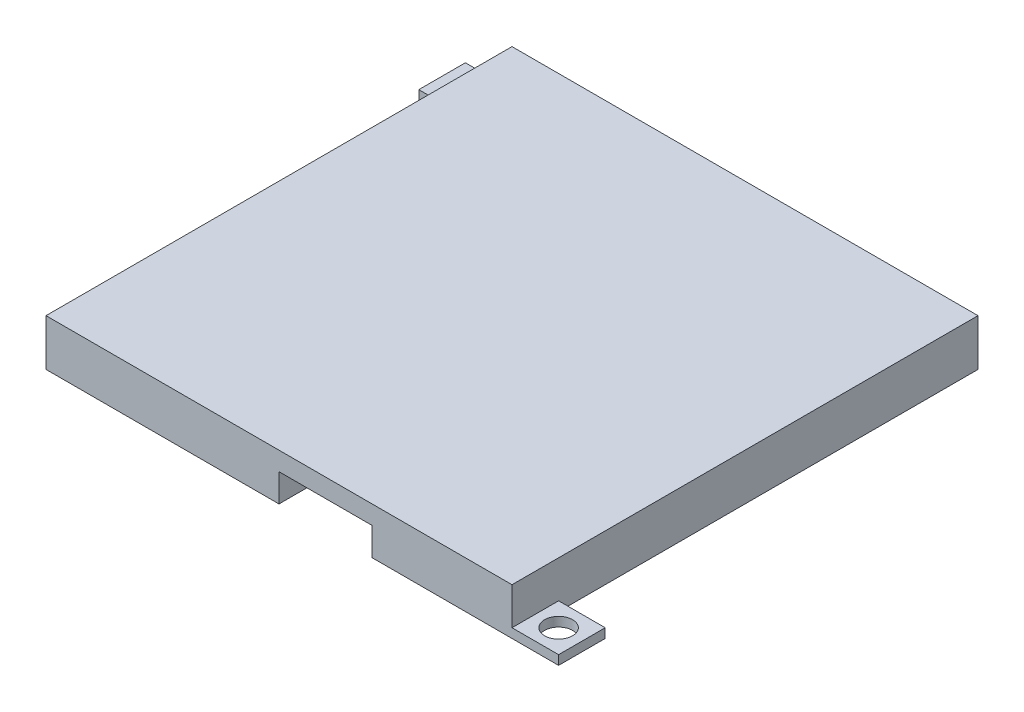
ISO-10303-21;
HEADER;
FILE_DESCRIPTION(('STEP AP214'),'2;1');
FILE_NAME('part.step','',(''),(''),'','','');
FILE_SCHEMA(('AUTOMOTIVE_DESIGN { 1 0 10303 214 1 1 1 1 }'));
ENDSEC;
DATA;
#1=APPLICATION_CONTEXT('core data for automotive mechanical design processes');
#2=APPLICATION_PROTOCOL_DEFINITION('international standard','automotive_design',2000,#1);
#3=PRODUCT_CONTEXT('',#1,'mechanical');
#4=PRODUCT('Part','Part','',(#3));
#5=PRODUCT_RELATED_PRODUCT_CATEGORY('part','',(#4));
#6=PRODUCT_DEFINITION_FORMATION('','',#4);
#7=PRODUCT_DEFINITION_CONTEXT('part definition',#1,'design');
#8=PRODUCT_DEFINITION('design','',#6,#7);
#9=PRODUCT_DEFINITION_SHAPE('','',#8);
#10=(LENGTH_UNIT() NAMED_UNIT(*) SI_UNIT(.MILLI.,.METRE.));
#11=(NAMED_UNIT(*) PLANE_ANGLE_UNIT() SI_UNIT($,.RADIAN.));
#12=(NAMED_UNIT(*) SI_UNIT($,.STERADIAN.) SOLID_ANGLE_UNIT());
#13=UNCERTAINTY_MEASURE_WITH_UNIT(LENGTH_MEASURE(1.E-05),#10,'distance_accuracy_value','');
#14=(GEOMETRIC_REPRESENTATION_CONTEXT(3) GLOBAL_UNCERTAINTY_ASSIGNED_CONTEXT((#13)) GLOBAL_UNIT_ASSIGNED_CONTEXT((#10,
#11,#12)) REPRESENTATION_CONTEXT('',''));
#15=CARTESIAN_POINT('',(0.,0.,0.));
#16=DIRECTION('',(0.,0.,1.));
#17=DIRECTION('',(1.,0.,0.));
#18=AXIS2_PLACEMENT_3D('',#15,#16,#17);
#19=CARTESIAN_POINT('',(20.,3.,20.));
#20=DIRECTION('',(0.,0.,1.));
#21=DIRECTION('',(1.,0.,0.));
#22=AXIS2_PLACEMENT_3D('',#19,#20,#21);
#23=PLANE('',#22);
#24=DIRECTION('',(-1.,0.,0.));
#25=VECTOR('',#24,1.);
#26=CARTESIAN_POINT('',(20.,3.,20.));
#27=LINE('',#26,#25);
#28=CARTESIAN_POINT('',(0.,3.,20.));
#29=VERTEX_POINT('',#28);
#30=CARTESIAN_POINT('',(-20.,3.,20.));
#31=VERTEX_POINT('',#30);
#32=EDGE_CURVE('E264',#29,#31,#27,.T.);
#33=ORIENTED_EDGE('',*,*,#32,.F.);
#34=DIRECTION('',(0.,-1.,0.));
#35=VECTOR('',#34,1.);
#36=CARTESIAN_POINT('',(0.,3.,20.));
#37=LINE('',#36,#35);
#38=CARTESIAN_POINT('',(0.,0.,20.));
#39=VERTEX_POINT('',#38);
#40=EDGE_CURVE('E366',#29,#39,#37,.T.);
#41=ORIENTED_EDGE('',*,*,#40,.T.);
#42=DIRECTION('',(-1.,0.,0.));
#43=VECTOR('',#42,1.);
#44=CARTESIAN_POINT('',(20.,0.,20.));
#45=LINE('',#44,#43);
#46=CARTESIAN_POINT('',(-20.,0.,20.));
#47=VERTEX_POINT('',#46);
#48=EDGE_CURVE('E185',#39,#47,#45,.T.);
#49=ORIENTED_EDGE('',*,*,#48,.T.);
#50=DIRECTION('',(0.,-1.,0.));
#51=VECTOR('',#50,1.);
#52=CARTESIAN_POINT('',(-20.,3.,20.));
#53=LINE('',#52,#51);
#54=EDGE_CURVE('E299',#31,#47,#53,.T.);
#55=ORIENTED_EDGE('',*,*,#54,.F.);
#56=EDGE_LOOP('',(#33,#41,#49,#55));
#57=FACE_BOUND('',#56,.T.);
#58=ADVANCED_FACE('F39',(#57),#23,.F.);
#59=CARTESIAN_POINT('',(25.,5.,25.));
#60=DIRECTION('',(-1.,0.,0.));
#61=DIRECTION('',(0.,0.,1.));
#62=AXIS2_PLACEMENT_3D('',#59,#60,#61);
#63=PLANE('',#62);
#64=DIRECTION('',(0.,-1.,0.));
#65=VECTOR('',#64,1.);
#66=CARTESIAN_POINT('',(25.,5.,25.));
#67=LINE('',#66,#65);
#68=CARTESIAN_POINT('',(25.,5.,25.));
#69=VERTEX_POINT('',#68);
#70=CARTESIAN_POINT('',(25.,1.,25.));
#71=VERTEX_POINT('',#70);
#72=EDGE_CURVE('E208',#69,#71,#67,.T.);
#73=ORIENTED_EDGE('',*,*,#72,.T.);
#74=DIRECTION('',(0.,0.,-1.));
#75=VECTOR('',#74,1.);
#76=CARTESIAN_POINT('',(25.,1.,20.));
#77=LINE('',#76,#75);
#78=CARTESIAN_POINT('',(25.,1.,20.));
#79=VERTEX_POINT('',#78);
#80=EDGE_CURVE('E343',#71,#79,#77,.T.);
#81=ORIENTED_EDGE('',*,*,#80,.T.);
#82=DIRECTION('',(0.,-1.,0.));
#83=VECTOR('',#82,1.);
#84=CARTESIAN_POINT('',(25.,1.,20.));
#85=LINE('',#84,#83);
#86=CARTESIAN_POINT('',(25.,0.,20.));
#87=VERTEX_POINT('',#86);
#88=EDGE_CURVE('E329',#79,#87,#85,.T.);
#89=ORIENTED_EDGE('',*,*,#88,.T.);
#90=DIRECTION('',(0.,0.,-1.));
#91=VECTOR('',#90,1.);
#92=CARTESIAN_POINT('',(25.,0.,25.));
#93=LINE('',#92,#91);
#94=CARTESIAN_POINT('',(25.,0.,-25.));
#95=VERTEX_POINT('',#94);
#96=EDGE_CURVE('E295',#87,#95,#93,.T.);
#97=ORIENTED_EDGE('',*,*,#96,.T.);
#98=DIRECTION('',(0.,-1.,0.));
#99=VECTOR('',#98,1.);
#100=CARTESIAN_POINT('',(25.,5.,-25.));
#101=LINE('',#100,#99);
#102=CARTESIAN_POINT('',(25.,5.,-25.));
#103=VERTEX_POINT('',#102);
#104=EDGE_CURVE('E11',#103,#95,#101,.T.);
#105=ORIENTED_EDGE('',*,*,#104,.F.);
#106=DIRECTION('',(0.,0.,-1.));
#107=VECTOR('',#106,1.);
#108=CARTESIAN_POINT('',(25.,5.,25.));
#109=LINE('',#108,#107);
#110=EDGE_CURVE('E196',#69,#103,#109,.T.);
#111=ORIENTED_EDGE('',*,*,#110,.F.);
#112=EDGE_LOOP('',(#73,#81,#89,#97,#105,#111));
#113=FACE_BOUND('',#112,.T.);
#114=ADVANCED_FACE('F41',(#113),#63,.F.);
#115=CARTESIAN_POINT('',(25.,5.,-25.));
#116=DIRECTION('',(0.,0.,1.));
#117=DIRECTION('',(1.,0.,0.));
#118=AXIS2_PLACEMENT_3D('',#115,#116,#117);
#119=PLANE('',#118);
#120=DIRECTION('',(-1.,0.,0.));
#121=VECTOR('',#120,1.);
#122=CARTESIAN_POINT('',(25.,0.,-25.));
#123=LINE('',#122,#121);
#124=CARTESIAN_POINT('',(-30.,0.,-25.));
#125=VERTEX_POINT('',#124);
#126=EDGE_CURVE('E313',#95,#125,#123,.T.);
#127=ORIENTED_EDGE('',*,*,#126,.T.);
#128=DIRECTION('',(0.,-1.,0.));
#129=VECTOR('',#128,1.);
#130=CARTESIAN_POINT('',(-30.,1.,-25.));
#131=LINE('',#130,#129);
#132=CARTESIAN_POINT('',(-30.,1.,-25.));
#133=VERTEX_POINT('',#132);
#134=EDGE_CURVE('E230',#133,#125,#131,.T.);
#135=ORIENTED_EDGE('',*,*,#134,.F.);
#136=DIRECTION('',(1.,0.,0.));
#137=VECTOR('',#136,1.);
#138=CARTESIAN_POINT('',(-25.,1.,-25.));
#139=LINE('',#138,#137);
#140=CARTESIAN_POINT('',(-25.,1.,-25.));
#141=VERTEX_POINT('',#140);
#142=EDGE_CURVE('E228',#133,#141,#139,.T.);
#143=ORIENTED_EDGE('',*,*,#142,.T.);
#144=DIRECTION('',(0.,-1.,0.));
#145=VECTOR('',#144,1.);
#146=CARTESIAN_POINT('',(-25.,5.,-25.));
#147=LINE('',#146,#145);
#148=CARTESIAN_POINT('',(-25.,5.,-25.));
#149=VERTEX_POINT('',#148);
#150=EDGE_CURVE('E48',#149,#141,#147,.T.);
#151=ORIENTED_EDGE('',*,*,#150,.F.);
#152=DIRECTION('',(-1.,0.,0.));
#153=VECTOR('',#152,1.);
#154=CARTESIAN_POINT('',(25.,5.,-25.));
#155=LINE('',#154,#153);
#156=EDGE_CURVE('E202',#103,#149,#155,.T.);
#157=ORIENTED_EDGE('',*,*,#156,.F.);
#158=ORIENTED_EDGE('',*,*,#104,.T.);
#159=EDGE_LOOP('',(#127,#135,#143,#151,#157,#158));
#160=FACE_BOUND('',#159,.T.);
#161=ADVANCED_FACE('F226',(#160),#119,.F.);
#162=CARTESIAN_POINT('',(-25.,5.,25.));
#163=DIRECTION('',(1.,0.,0.));
#164=DIRECTION('',(0.,0.,-1.));
#165=AXIS2_PLACEMENT_3D('',#162,#163,#164);
#166=PLANE('',#165);
#167=ORIENTED_EDGE('',*,*,#150,.T.);
#168=DIRECTION('',(0.,0.,1.));
#169=VECTOR('',#168,1.);
#170=CARTESIAN_POINT('',(-25.,1.,-20.));
#171=LINE('',#170,#169);
#172=CARTESIAN_POINT('',(-25.,1.,-20.));
#173=VERTEX_POINT('',#172);
#174=EDGE_CURVE('E222',#141,#173,#171,.T.);
#175=ORIENTED_EDGE('',*,*,#174,.T.);
#176=DIRECTION('',(0.,-1.,0.));
#177=VECTOR('',#176,1.);
#178=CARTESIAN_POINT('',(-25.,1.,-20.));
#179=LINE('',#178,#177);
#180=CARTESIAN_POINT('',(-25.,0.,-20.));
#181=VERTEX_POINT('',#180);
#182=EDGE_CURVE('E235',#173,#181,#179,.T.);
#183=ORIENTED_EDGE('',*,*,#182,.T.);
#184=DIRECTION('',(0.,0.,1.));
#185=VECTOR('',#184,1.);
#186=CARTESIAN_POINT('',(-25.,0.,25.));
#187=LINE('',#186,#185);
#188=CARTESIAN_POINT('',(-25.,0.,25.));
#189=VERTEX_POINT('',#188);
#190=EDGE_CURVE('E204',#181,#189,#187,.T.);
#191=ORIENTED_EDGE('',*,*,#190,.T.);
#192=DIRECTION('',(0.,-1.,0.));
#193=VECTOR('',#192,1.);
#194=CARTESIAN_POINT('',(-25.,5.,25.));
#195=LINE('',#194,#193);
#196=CARTESIAN_POINT('',(-25.,5.,25.));
#197=VERTEX_POINT('',#196);
#198=EDGE_CURVE('E194',#197,#189,#195,.T.);
#199=ORIENTED_EDGE('',*,*,#198,.F.);
#200=DIRECTION('',(0.,0.,1.));
#201=VECTOR('',#200,1.);
#202=CARTESIAN_POINT('',(-25.,5.,25.));
#203=LINE('',#202,#201);
#204=EDGE_CURVE('E223',#149,#197,#203,.T.);
#205=ORIENTED_EDGE('',*,*,#204,.F.);
#206=EDGE_LOOP('',(#167,#175,#183,#191,#199,#205));
#207=FACE_BOUND('',#206,.T.);
#208=ADVANCED_FACE('F220',(#207),#166,.F.);
#209=CARTESIAN_POINT('',(25.,5.,25.));
#210=DIRECTION('',(0.,0.,-1.));
#211=DIRECTION('',(-1.,0.,0.));
#212=AXIS2_PLACEMENT_3D('',#209,#210,#211);
#213=PLANE('',#212);
#214=DIRECTION('',(1.,0.,0.));
#215=VECTOR('',#214,1.);
#216=CARTESIAN_POINT('',(25.,0.,25.));
#217=LINE('',#216,#215);
#218=CARTESIAN_POINT('',(0.,0.,25.));
#219=VERTEX_POINT('',#218);
#220=EDGE_CURVE('E183',#189,#219,#217,.T.);
#221=ORIENTED_EDGE('',*,*,#220,.T.);
#222=DIRECTION('',(0.,-1.,0.));
#223=VECTOR('',#222,1.);
#224=CARTESIAN_POINT('',(0.,0.,25.));
#225=LINE('',#224,#223);
#226=CARTESIAN_POINT('',(0.,3.,25.));
#227=VERTEX_POINT('',#226);
#228=EDGE_CURVE('E164',#227,#219,#225,.T.);
#229=ORIENTED_EDGE('',*,*,#228,.F.);
#230=DIRECTION('',(-1.,0.,0.));
#231=VECTOR('',#230,1.);
#232=CARTESIAN_POINT('',(0.,3.,25.));
#233=LINE('',#232,#231);
#234=CARTESIAN_POINT('',(10.,3.,25.));
#235=VERTEX_POINT('',#234);
#236=EDGE_CURVE('E188',#235,#227,#233,.T.);
#237=ORIENTED_EDGE('',*,*,#236,.F.);
#238=DIRECTION('',(0.,1.,0.));
#239=VECTOR('',#238,1.);
#240=CARTESIAN_POINT('',(10.,3.,25.));
#241=LINE('',#240,#239);
#242=CARTESIAN_POINT('',(10.,0.,25.));
#243=VERTEX_POINT('',#242);
#244=EDGE_CURVE('E176',#243,#235,#241,.T.);
#245=ORIENTED_EDGE('',*,*,#244,.F.);
#246=CARTESIAN_POINT('',(30.,0.,25.));
#247=VERTEX_POINT('',#246);
#248=EDGE_CURVE('E197',#243,#247,#217,.T.);
#249=ORIENTED_EDGE('',*,*,#248,.T.);
#250=DIRECTION('',(0.,-1.,0.));
#251=VECTOR('',#250,1.);
#252=CARTESIAN_POINT('',(30.,1.,25.));
#253=LINE('',#252,#251);
#254=CARTESIAN_POINT('',(30.,1.,25.));
#255=VERTEX_POINT('',#254);
#256=EDGE_CURVE('E251',#255,#247,#253,.T.);
#257=ORIENTED_EDGE('',*,*,#256,.F.);
#258=DIRECTION('',(-1.,0.,0.));
#259=VECTOR('',#258,1.);
#260=CARTESIAN_POINT('',(25.,1.,25.));
#261=LINE('',#260,#259);
#262=EDGE_CURVE('E333',#255,#71,#261,.T.);
#263=ORIENTED_EDGE('',*,*,#262,.T.);
#264=ORIENTED_EDGE('',*,*,#72,.F.);
#265=DIRECTION('',(1.,0.,0.));
#266=VECTOR('',#265,1.);
#267=CARTESIAN_POINT('',(25.,5.,25.));
#268=LINE('',#267,#266);
#269=EDGE_CURVE('E212',#197,#69,#268,.T.);
#270=ORIENTED_EDGE('',*,*,#269,.F.);
#271=ORIENTED_EDGE('',*,*,#198,.T.);
#272=EDGE_LOOP('',(#221,#229,#237,#245,#249,#257,#263,#264,#270,#271));
#273=FACE_BOUND('',#272,.T.);
#274=ADVANCED_FACE('F191',(#273),#213,.F.);
#275=CARTESIAN_POINT('',(0.,5.,0.));
#276=DIRECTION('',(0.,1.,0.));
#277=DIRECTION('',(0.,0.,1.));
#278=AXIS2_PLACEMENT_3D('',#275,#276,#277);
#279=PLANE('',#278);
#280=ORIENTED_EDGE('',*,*,#110,.T.);
#281=ORIENTED_EDGE('',*,*,#156,.T.);
#282=ORIENTED_EDGE('',*,*,#204,.T.);
#283=ORIENTED_EDGE('',*,*,#269,.T.);
#284=EDGE_LOOP('',(#280,#281,#282,#283));
#285=FACE_BOUND('',#284,.T.);
#286=ADVANCED_FACE('F417',(#285),#279,.T.);
#287=CARTESIAN_POINT('',(0.,0.,0.));
#288=DIRECTION('',(0.,1.,0.));
#289=DIRECTION('',(0.,0.,1.));
#290=AXIS2_PLACEMENT_3D('',#287,#288,#289);
#291=PLANE('',#290);
#292=CARTESIAN_POINT('',(-27.5,0.,-22.5));
#293=DIRECTION('',(0.,1.,0.));
#294=DIRECTION('',(0.,0.,1.));
#295=AXIS2_PLACEMENT_3D('',#292,#293,#294);
#296=CIRCLE('',#295,1.5);
#297=CARTESIAN_POINT('',(-27.5,0.,-21.));
#298=VERTEX_POINT('',#297);
#299=EDGE_CURVE('E346',#298,#298,#296,.T.);
#300=ORIENTED_EDGE('',*,*,#299,.T.);
#301=EDGE_LOOP('',(#300));
#302=FACE_BOUND('',#301,.T.);
#303=CARTESIAN_POINT('',(27.5,0.,22.5));
#304=DIRECTION('',(0.,1.,0.));
#305=DIRECTION('',(0.,0.,1.));
#306=AXIS2_PLACEMENT_3D('',#303,#304,#305);
#307=CIRCLE('',#306,1.5);
#308=CARTESIAN_POINT('',(27.5,0.,24.));
#309=VERTEX_POINT('',#308);
#310=EDGE_CURVE('E365',#309,#309,#307,.T.);
#311=ORIENTED_EDGE('',*,*,#310,.T.);
#312=EDGE_LOOP('',(#311));
#313=FACE_BOUND('',#312,.T.);
#314=ORIENTED_EDGE('',*,*,#48,.F.);
#315=DIRECTION('',(0.,0.,1.));
#316=VECTOR('',#315,1.);
#317=CARTESIAN_POINT('',(0.,0.,15.));
#318=LINE('',#317,#316);
#319=EDGE_CURVE('E167',#39,#219,#318,.T.);
#320=ORIENTED_EDGE('',*,*,#319,.T.);
#321=ORIENTED_EDGE('',*,*,#220,.F.);
#322=ORIENTED_EDGE('',*,*,#190,.F.);
#323=DIRECTION('',(-1.,0.,0.));
#324=VECTOR('',#323,1.);
#325=CARTESIAN_POINT('',(-30.,0.,-20.));
#326=LINE('',#325,#324);
#327=CARTESIAN_POINT('',(-30.,0.,-20.));
#328=VERTEX_POINT('',#327);
#329=EDGE_CURVE('E246',#181,#328,#326,.T.);
#330=ORIENTED_EDGE('',*,*,#329,.T.);
#331=DIRECTION('',(0.,0.,-1.));
#332=VECTOR('',#331,1.);
#333=CARTESIAN_POINT('',(-30.,0.,-25.));
#334=LINE('',#333,#332);
#335=EDGE_CURVE('E250',#328,#125,#334,.T.);
#336=ORIENTED_EDGE('',*,*,#335,.T.);
#337=ORIENTED_EDGE('',*,*,#126,.F.);
#338=ORIENTED_EDGE('',*,*,#96,.F.);
#339=DIRECTION('',(1.,0.,0.));
#340=VECTOR('',#339,1.);
#341=CARTESIAN_POINT('',(30.,0.,20.));
#342=LINE('',#341,#340);
#343=CARTESIAN_POINT('',(30.,0.,20.));
#344=VERTEX_POINT('',#343);
#345=EDGE_CURVE('E63',#87,#344,#342,.T.);
#346=ORIENTED_EDGE('',*,*,#345,.T.);
#347=DIRECTION('',(0.,0.,1.));
#348=VECTOR('',#347,1.);
#349=CARTESIAN_POINT('',(30.,0.,25.));
#350=LINE('',#349,#348);
#351=EDGE_CURVE('E339',#344,#247,#350,.T.);
#352=ORIENTED_EDGE('',*,*,#351,.T.);
#353=ORIENTED_EDGE('',*,*,#248,.F.);
#354=DIRECTION('',(0.,0.,1.));
#355=VECTOR('',#354,1.);
#356=CARTESIAN_POINT('',(10.,0.,15.));
#357=LINE('',#356,#355);
#358=CARTESIAN_POINT('',(10.,0.,20.));
#359=VERTEX_POINT('',#358);
#360=EDGE_CURVE('E187',#359,#243,#357,.T.);
#361=ORIENTED_EDGE('',*,*,#360,.F.);
#362=CARTESIAN_POINT('',(20.,0.,20.));
#363=VERTEX_POINT('',#362);
#364=EDGE_CURVE('E281',#363,#359,#45,.T.);
#365=ORIENTED_EDGE('',*,*,#364,.F.);
#366=DIRECTION('',(0.,0.,1.));
#367=VECTOR('',#366,1.);
#368=CARTESIAN_POINT('',(20.,0.,20.));
#369=LINE('',#368,#367);
#370=CARTESIAN_POINT('',(20.,0.,-20.));
#371=VERTEX_POINT('',#370);
#372=EDGE_CURVE('E257',#371,#363,#369,.T.);
#373=ORIENTED_EDGE('',*,*,#372,.F.);
#374=DIRECTION('',(1.,0.,0.));
#375=VECTOR('',#374,1.);
#376=CARTESIAN_POINT('',(20.,0.,-20.));
#377=LINE('',#376,#375);
#378=CARTESIAN_POINT('',(-20.,0.,-20.));
#379=VERTEX_POINT('',#378);
#380=EDGE_CURVE('E265',#379,#371,#377,.T.);
#381=ORIENTED_EDGE('',*,*,#380,.F.);
#382=DIRECTION('',(0.,0.,-1.));
#383=VECTOR('',#382,1.);
#384=CARTESIAN_POINT('',(-20.,0.,20.));
#385=LINE('',#384,#383);
#386=EDGE_CURVE('E285',#47,#379,#385,.T.);
#387=ORIENTED_EDGE('',*,*,#386,.F.);
#388=EDGE_LOOP('',(#314,#320,#321,#322,#330,#336,#337,#338,#346,#352,#353,#361,#365,#373,#381,#387));
#389=FACE_BOUND('',#388,.T.);
#390=ADVANCED_FACE('F181',(#302,#313,#389),#291,.F.);
#391=CARTESIAN_POINT('',(20.,3.,20.));
#392=DIRECTION('',(1.,0.,0.));
#393=DIRECTION('',(0.,0.,-1.));
#394=AXIS2_PLACEMENT_3D('',#391,#392,#393);
#395=PLANE('',#394);
#396=ORIENTED_EDGE('',*,*,#372,.T.);
#397=DIRECTION('',(0.,-1.,0.));
#398=VECTOR('',#397,1.);
#399=CARTESIAN_POINT('',(20.,3.,20.));
#400=LINE('',#399,#398);
#401=CARTESIAN_POINT('',(20.,3.,20.));
#402=VERTEX_POINT('',#401);
#403=EDGE_CURVE('E278',#402,#363,#400,.T.);
#404=ORIENTED_EDGE('',*,*,#403,.F.);
#405=DIRECTION('',(0.,0.,1.));
#406=VECTOR('',#405,1.);
#407=CARTESIAN_POINT('',(20.,3.,20.));
#408=LINE('',#407,#406);
#409=CARTESIAN_POINT('',(20.,3.,-20.));
#410=VERTEX_POINT('',#409);
#411=EDGE_CURVE('E260',#410,#402,#408,.T.);
#412=ORIENTED_EDGE('',*,*,#411,.F.);
#413=DIRECTION('',(0.,-1.,0.));
#414=VECTOR('',#413,1.);
#415=CARTESIAN_POINT('',(20.,3.,-20.));
#416=LINE('',#415,#414);
#417=EDGE_CURVE('E292',#410,#371,#416,.T.);
#418=ORIENTED_EDGE('',*,*,#417,.T.);
#419=EDGE_LOOP('',(#396,#404,#412,#418));
#420=FACE_BOUND('',#419,.T.);
#421=ADVANCED_FACE('F424',(#420),#395,.F.);
#422=CARTESIAN_POINT('',(20.,3.,-20.));
#423=DIRECTION('',(0.,0.,-1.));
#424=DIRECTION('',(-1.,0.,0.));
#425=AXIS2_PLACEMENT_3D('',#422,#423,#424);
#426=PLANE('',#425);
#427=ORIENTED_EDGE('',*,*,#380,.T.);
#428=ORIENTED_EDGE('',*,*,#417,.F.);
#429=DIRECTION('',(1.,0.,0.));
#430=VECTOR('',#429,1.);
#431=CARTESIAN_POINT('',(20.,3.,-20.));
#432=LINE('',#431,#430);
#433=CARTESIAN_POINT('',(-20.,3.,-20.));
#434=VERTEX_POINT('',#433);
#435=EDGE_CURVE('E274',#434,#410,#432,.T.);
#436=ORIENTED_EDGE('',*,*,#435,.F.);
#437=DIRECTION('',(0.,-1.,0.));
#438=VECTOR('',#437,1.);
#439=CARTESIAN_POINT('',(-20.,3.,-20.));
#440=LINE('',#439,#438);
#441=EDGE_CURVE('E296',#434,#379,#440,.T.);
#442=ORIENTED_EDGE('',*,*,#441,.T.);
#443=EDGE_LOOP('',(#427,#428,#436,#442));
#444=FACE_BOUND('',#443,.T.);
#445=ADVANCED_FACE('F443',(#444),#426,.F.);
#446=CARTESIAN_POINT('',(-20.,3.,20.));
#447=DIRECTION('',(-1.,0.,0.));
#448=DIRECTION('',(0.,0.,1.));
#449=AXIS2_PLACEMENT_3D('',#446,#447,#448);
#450=PLANE('',#449);
#451=ORIENTED_EDGE('',*,*,#386,.T.);
#452=ORIENTED_EDGE('',*,*,#441,.F.);
#453=DIRECTION('',(0.,0.,-1.));
#454=VECTOR('',#453,1.);
#455=CARTESIAN_POINT('',(-20.,3.,20.));
#456=LINE('',#455,#454);
#457=EDGE_CURVE('E270',#31,#434,#456,.T.);
#458=ORIENTED_EDGE('',*,*,#457,.F.);
#459=ORIENTED_EDGE('',*,*,#54,.T.);
#460=EDGE_LOOP('',(#451,#452,#458,#459));
#461=FACE_BOUND('',#460,.T.);
#462=ADVANCED_FACE('F437',(#461),#450,.F.);
#463=ORIENTED_EDGE('',*,*,#364,.T.);
#464=DIRECTION('',(0.,1.,0.));
#465=VECTOR('',#464,1.);
#466=CARTESIAN_POINT('',(10.,3.,20.));
#467=LINE('',#466,#465);
#468=CARTESIAN_POINT('',(10.,3.,20.));
#469=VERTEX_POINT('',#468);
#470=EDGE_CURVE('E379',#359,#469,#467,.T.);
#471=ORIENTED_EDGE('',*,*,#470,.T.);
#472=EDGE_CURVE('E266',#402,#469,#27,.T.);
#473=ORIENTED_EDGE('',*,*,#472,.F.);
#474=ORIENTED_EDGE('',*,*,#403,.T.);
#475=EDGE_LOOP('',(#463,#471,#473,#474));
#476=FACE_BOUND('',#475,.T.);
#477=ADVANCED_FACE('F401',(#476),#23,.F.);
#478=CARTESIAN_POINT('',(0.,3.,0.));
#479=DIRECTION('',(0.,1.,0.));
#480=DIRECTION('',(0.,0.,1.));
#481=AXIS2_PLACEMENT_3D('',#478,#479,#480);
#482=PLANE('',#481);
#483=ORIENTED_EDGE('',*,*,#472,.T.);
#484=DIRECTION('',(0.,0.,1.));
#485=VECTOR('',#484,1.);
#486=CARTESIAN_POINT('',(10.,3.,15.));
#487=LINE('',#486,#485);
#488=EDGE_CURVE('E55',#469,#235,#487,.T.);
#489=ORIENTED_EDGE('',*,*,#488,.T.);
#490=ORIENTED_EDGE('',*,*,#236,.T.);
#491=DIRECTION('',(0.,0.,1.));
#492=VECTOR('',#491,1.);
#493=CARTESIAN_POINT('',(0.,3.,15.));
#494=LINE('',#493,#492);
#495=EDGE_CURVE('E170',#29,#227,#494,.T.);
#496=ORIENTED_EDGE('',*,*,#495,.F.);
#497=ORIENTED_EDGE('',*,*,#32,.T.);
#498=ORIENTED_EDGE('',*,*,#457,.T.);
#499=ORIENTED_EDGE('',*,*,#435,.T.);
#500=ORIENTED_EDGE('',*,*,#411,.T.);
#501=EDGE_LOOP('',(#483,#489,#490,#496,#497,#498,#499,#500));
#502=FACE_BOUND('',#501,.T.);
#503=ADVANCED_FACE('F396',(#502),#482,.F.);
#504=CARTESIAN_POINT('',(-30.,1.,-25.));
#505=DIRECTION('',(-1.,0.,0.));
#506=DIRECTION('',(0.,0.,1.));
#507=AXIS2_PLACEMENT_3D('',#504,#505,#506);
#508=PLANE('',#507);
#509=ORIENTED_EDGE('',*,*,#335,.F.);
#510=DIRECTION('',(0.,-1.,0.));
#511=VECTOR('',#510,1.);
#512=CARTESIAN_POINT('',(-30.,1.,-20.));
#513=LINE('',#512,#511);
#514=CARTESIAN_POINT('',(-30.,1.,-20.));
#515=VERTEX_POINT('',#514);
#516=EDGE_CURVE('E240',#515,#328,#513,.T.);
#517=ORIENTED_EDGE('',*,*,#516,.F.);
#518=DIRECTION('',(0.,0.,-1.));
#519=VECTOR('',#518,1.);
#520=CARTESIAN_POINT('',(-30.,1.,-25.));
#521=LINE('',#520,#519);
#522=EDGE_CURVE('E236',#515,#133,#521,.T.);
#523=ORIENTED_EDGE('',*,*,#522,.T.);
#524=ORIENTED_EDGE('',*,*,#134,.T.);
#525=EDGE_LOOP('',(#509,#517,#523,#524));
#526=FACE_BOUND('',#525,.T.);
#527=ADVANCED_FACE('F323',(#526),#508,.T.);
#528=CARTESIAN_POINT('',(-30.,1.,-20.));
#529=DIRECTION('',(0.,0.,1.));
#530=DIRECTION('',(1.,0.,0.));
#531=AXIS2_PLACEMENT_3D('',#528,#529,#530);
#532=PLANE('',#531);
#533=ORIENTED_EDGE('',*,*,#329,.F.);
#534=ORIENTED_EDGE('',*,*,#182,.F.);
#535=DIRECTION('',(-1.,0.,0.));
#536=VECTOR('',#535,1.);
#537=CARTESIAN_POINT('',(-30.,1.,-20.));
#538=LINE('',#537,#536);
#539=EDGE_CURVE('E242',#173,#515,#538,.T.);
#540=ORIENTED_EDGE('',*,*,#539,.T.);
#541=ORIENTED_EDGE('',*,*,#516,.T.);
#542=EDGE_LOOP('',(#533,#534,#540,#541));
#543=FACE_BOUND('',#542,.T.);
#544=ADVANCED_FACE('F319',(#543),#532,.T.);
#545=CARTESIAN_POINT('',(0.,1.,0.));
#546=DIRECTION('',(0.,1.,0.));
#547=DIRECTION('',(0.,0.,1.));
#548=AXIS2_PLACEMENT_3D('',#545,#546,#547);
#549=PLANE('',#548);
#550=CARTESIAN_POINT('',(-27.5,1.,-22.5));
#551=DIRECTION('',(0.,1.,0.));
#552=DIRECTION('',(0.,0.,1.));
#553=AXIS2_PLACEMENT_3D('',#550,#551,#552);
#554=CIRCLE('',#553,1.5);
#555=CARTESIAN_POINT('',(-27.5,1.,-21.));
#556=VERTEX_POINT('',#555);
#557=EDGE_CURVE('E370',#556,#556,#554,.T.);
#558=ORIENTED_EDGE('',*,*,#557,.F.);
#559=EDGE_LOOP('',(#558));
#560=FACE_BOUND('',#559,.T.);
#561=ORIENTED_EDGE('',*,*,#174,.F.);
#562=ORIENTED_EDGE('',*,*,#142,.F.);
#563=ORIENTED_EDGE('',*,*,#522,.F.);
#564=ORIENTED_EDGE('',*,*,#539,.F.);
#565=EDGE_LOOP('',(#561,#562,#563,#564));
#566=FACE_BOUND('',#565,.T.);
#567=ADVANCED_FACE('F324',(#560,#566),#549,.T.);
#568=CARTESIAN_POINT('',(30.,1.,25.));
#569=DIRECTION('',(1.,0.,0.));
#570=DIRECTION('',(0.,0.,-1.));
#571=AXIS2_PLACEMENT_3D('',#568,#569,#570);
#572=PLANE('',#571);
#573=ORIENTED_EDGE('',*,*,#351,.F.);
#574=DIRECTION('',(0.,-1.,0.));
#575=VECTOR('',#574,1.);
#576=CARTESIAN_POINT('',(30.,1.,20.));
#577=LINE('',#576,#575);
#578=CARTESIAN_POINT('',(30.,1.,20.));
#579=VERTEX_POINT('',#578);
#580=EDGE_CURVE('E332',#579,#344,#577,.T.);
#581=ORIENTED_EDGE('',*,*,#580,.F.);
#582=DIRECTION('',(0.,0.,1.));
#583=VECTOR('',#582,1.);
#584=CARTESIAN_POINT('',(30.,1.,25.));
#585=LINE('',#584,#583);
#586=EDGE_CURVE('E350',#579,#255,#585,.T.);
#587=ORIENTED_EDGE('',*,*,#586,.T.);
#588=ORIENTED_EDGE('',*,*,#256,.T.);
#589=EDGE_LOOP('',(#573,#581,#587,#588));
#590=FACE_BOUND('',#589,.T.);
#591=ADVANCED_FACE('F406',(#590),#572,.T.);
#592=CARTESIAN_POINT('',(30.,1.,20.));
#593=DIRECTION('',(0.,0.,-1.));
#594=DIRECTION('',(-1.,0.,0.));
#595=AXIS2_PLACEMENT_3D('',#592,#593,#594);
#596=PLANE('',#595);
#597=ORIENTED_EDGE('',*,*,#345,.F.);
#598=ORIENTED_EDGE('',*,*,#88,.F.);
#599=DIRECTION('',(1.,0.,0.));
#600=VECTOR('',#599,1.);
#601=CARTESIAN_POINT('',(30.,1.,20.));
#602=LINE('',#601,#600);
#603=EDGE_CURVE('E354',#79,#579,#602,.T.);
#604=ORIENTED_EDGE('',*,*,#603,.T.);
#605=ORIENTED_EDGE('',*,*,#580,.T.);
#606=EDGE_LOOP('',(#597,#598,#604,#605));
#607=FACE_BOUND('',#606,.T.);
#608=ADVANCED_FACE('F458',(#607),#596,.T.);
#609=CARTESIAN_POINT('',(0.,1.,0.));
#610=DIRECTION('',(0.,1.,0.));
#611=DIRECTION('',(0.,0.,1.));
#612=AXIS2_PLACEMENT_3D('',#609,#610,#611);
#613=PLANE('',#612);
#614=CARTESIAN_POINT('',(27.5,1.,22.5));
#615=DIRECTION('',(0.,1.,0.));
#616=DIRECTION('',(0.,0.,1.));
#617=AXIS2_PLACEMENT_3D('',#614,#615,#616);
#618=CIRCLE('',#617,1.5);
#619=CARTESIAN_POINT('',(27.5,1.,24.));
#620=VERTEX_POINT('',#619);
#621=EDGE_CURVE('E361',#620,#620,#618,.T.);
#622=ORIENTED_EDGE('',*,*,#621,.F.);
#623=EDGE_LOOP('',(#622));
#624=FACE_BOUND('',#623,.T.);
#625=ORIENTED_EDGE('',*,*,#80,.F.);
#626=ORIENTED_EDGE('',*,*,#262,.F.);
#627=ORIENTED_EDGE('',*,*,#586,.F.);
#628=ORIENTED_EDGE('',*,*,#603,.F.);
#629=EDGE_LOOP('',(#625,#626,#627,#628));
#630=FACE_BOUND('',#629,.T.);
#631=ADVANCED_FACE('F411',(#624,#630),#613,.T.);
#632=CARTESIAN_POINT('',(27.5,0.,22.5));
#633=DIRECTION('',(0.,1.,0.));
#634=DIRECTION('',(0.,0.,1.));
#635=AXIS2_PLACEMENT_3D('',#632,#633,#634);
#636=CYLINDRICAL_SURFACE('',#635,1.5);
#637=ORIENTED_EDGE('',*,*,#310,.F.);
#638=EDGE_LOOP('',(#637));
#639=FACE_BOUND('',#638,.T.);
#640=ORIENTED_EDGE('',*,*,#621,.T.);
#641=EDGE_LOOP('',(#640));
#642=FACE_BOUND('',#641,.T.);
#643=ADVANCED_FACE('F465',(#639,#642),#636,.F.);
#644=CARTESIAN_POINT('',(-27.5,0.,-22.5));
#645=DIRECTION('',(0.,1.,0.));
#646=DIRECTION('',(0.,0.,1.));
#647=AXIS2_PLACEMENT_3D('',#644,#645,#646);
#648=CYLINDRICAL_SURFACE('',#647,1.5);
#649=ORIENTED_EDGE('',*,*,#299,.F.);
#650=EDGE_LOOP('',(#649));
#651=FACE_BOUND('',#650,.T.);
#652=ORIENTED_EDGE('',*,*,#557,.T.);
#653=EDGE_LOOP('',(#652));
#654=FACE_BOUND('',#653,.T.);
#655=ADVANCED_FACE('F469',(#651,#654),#648,.F.);
#656=CARTESIAN_POINT('',(0.,0.,15.));
#657=DIRECTION('',(-1.,0.,0.));
#658=DIRECTION('',(0.,0.,1.));
#659=AXIS2_PLACEMENT_3D('',#656,#657,#658);
#660=PLANE('',#659);
#661=ORIENTED_EDGE('',*,*,#495,.T.);
#662=ORIENTED_EDGE('',*,*,#228,.T.);
#663=ORIENTED_EDGE('',*,*,#319,.F.);
#664=ORIENTED_EDGE('',*,*,#40,.F.);
#665=EDGE_LOOP('',(#661,#662,#663,#664));
#666=FACE_BOUND('',#665,.T.);
#667=ADVANCED_FACE('F166',(#666),#660,.F.);
#668=CARTESIAN_POINT('',(10.,3.,15.));
#669=DIRECTION('',(1.,0.,0.));
#670=DIRECTION('',(0.,0.,-1.));
#671=AXIS2_PLACEMENT_3D('',#668,#669,#670);
#672=PLANE('',#671);
#673=ORIENTED_EDGE('',*,*,#360,.T.);
#674=ORIENTED_EDGE('',*,*,#244,.T.);
#675=ORIENTED_EDGE('',*,*,#488,.F.);
#676=ORIENTED_EDGE('',*,*,#470,.F.);
#677=EDGE_LOOP('',(#673,#674,#675,#676));
#678=FACE_BOUND('',#677,.T.);
#679=ADVANCED_FACE('F392',(#678),#672,.F.);
#680=CLOSED_SHELL('',(#58,#114,#161,#208,#274,#286,#390,#421,#445,#462,#477,#503,#527,#544,#567,
#591,#608,#631,#643,#655,#667,#679));
#681=MANIFOLD_SOLID_BREP('B2',#680);
#682=ADVANCED_BREP_SHAPE_REPRESENTATION('',(#18,#681),#14);
#683=SHAPE_DEFINITION_REPRESENTATION(#9,#682);
ENDSEC;
END-ISO-10303-21;
